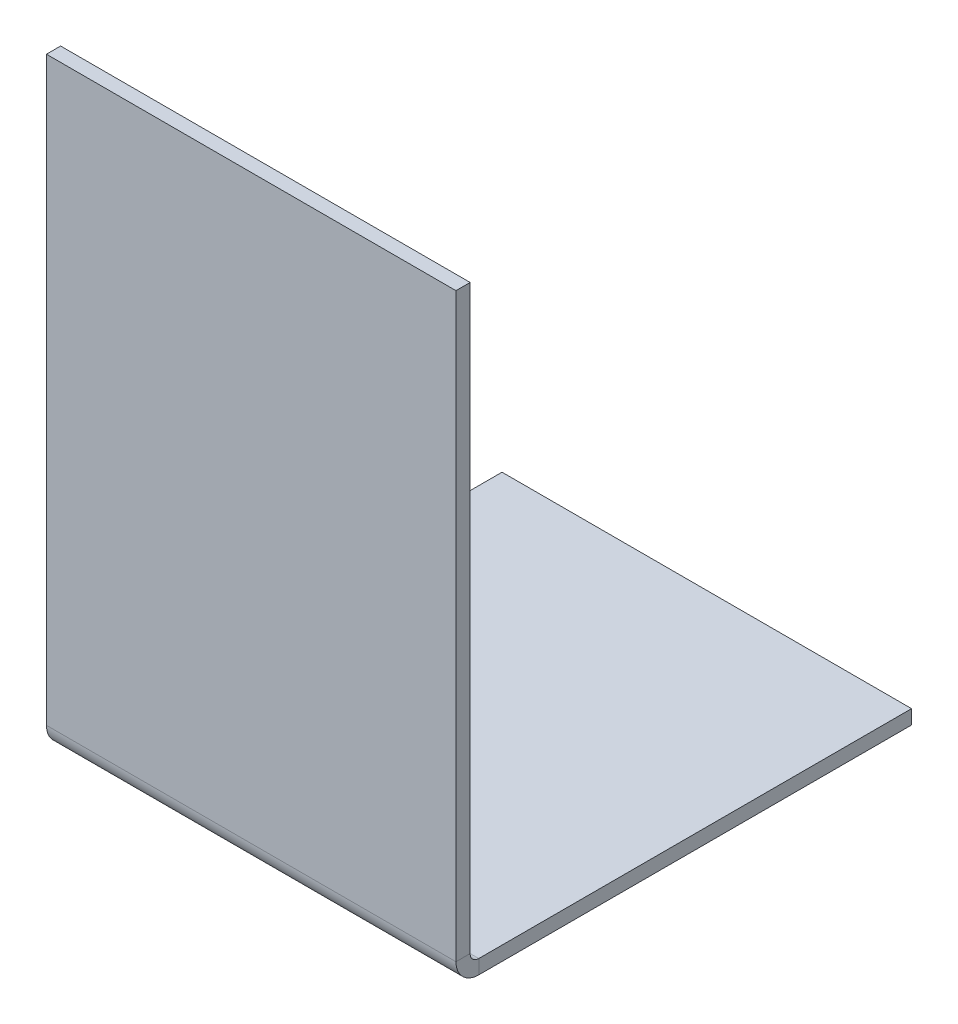
ISO-10303-21;
HEADER;
FILE_DESCRIPTION(('STEP AP214'),'2;1');
FILE_NAME('part.step','',(''),(''),'','','');
FILE_SCHEMA(('AUTOMOTIVE_DESIGN { 1 0 10303 214 1 1 1 1 }'));
ENDSEC;
DATA;
#1=APPLICATION_CONTEXT('core data for automotive mechanical design processes');
#2=APPLICATION_PROTOCOL_DEFINITION('international standard','automotive_design',2000,#1);
#3=PRODUCT_CONTEXT('',#1,'mechanical');
#4=PRODUCT('Part','Part','',(#3));
#5=PRODUCT_RELATED_PRODUCT_CATEGORY('part','',(#4));
#6=PRODUCT_DEFINITION_FORMATION('','',#4);
#7=PRODUCT_DEFINITION_CONTEXT('part definition',#1,'design');
#8=PRODUCT_DEFINITION('design','',#6,#7);
#9=PRODUCT_DEFINITION_SHAPE('','',#8);
#10=(LENGTH_UNIT() NAMED_UNIT(*) SI_UNIT(.MILLI.,.METRE.));
#11=(NAMED_UNIT(*) PLANE_ANGLE_UNIT() SI_UNIT($,.RADIAN.));
#12=(NAMED_UNIT(*) SI_UNIT($,.STERADIAN.) SOLID_ANGLE_UNIT());
#13=UNCERTAINTY_MEASURE_WITH_UNIT(LENGTH_MEASURE(1.E-05),#10,'distance_accuracy_value','');
#14=(GEOMETRIC_REPRESENTATION_CONTEXT(3) GLOBAL_UNCERTAINTY_ASSIGNED_CONTEXT((#13)) GLOBAL_UNIT_ASSIGNED_CONTEXT((#10,
#11,#12)) REPRESENTATION_CONTEXT('',''));
#15=CARTESIAN_POINT('',(0.,0.,0.));
#16=DIRECTION('',(0.,0.,1.));
#17=DIRECTION('',(1.,0.,0.));
#18=AXIS2_PLACEMENT_3D('',#15,#16,#17);
#19=CARTESIAN_POINT('',(17.526,50.4812919037694,-5.45458809623079));
#20=DIRECTION('',(1.,0.,0.));
#21=DIRECTION('',(0.,-1.,0.));
#22=AXIS2_PLACEMENT_3D('',#19,#20,#21);
#23=PLANE('',#22);
#24=DIRECTION('',(0.,-1.,0.));
#25=VECTOR('',#24,1.);
#26=CARTESIAN_POINT('',(17.526,50.4812919037694,-5.45458809623079));
#27=LINE('',#26,#25);
#28=CARTESIAN_POINT('',(17.526,50.4812919037694,-5.45458809623079));
#29=VERTEX_POINT('',#28);
#30=CARTESIAN_POINT('',(17.526,0.736600000000006,-5.45458809623062));
#31=VERTEX_POINT('',#30);
#32=EDGE_CURVE('E105',#29,#31,#27,.T.);
#33=ORIENTED_EDGE('',*,*,#32,.T.);
#34=DIRECTION('',(0.,0.,-1.));
#35=VECTOR('',#34,1.);
#36=CARTESIAN_POINT('',(17.526,0.736600000000006,-5.45458809623062));
#37=LINE('',#36,#35);
#38=CARTESIAN_POINT('',(17.526,0.736600000000004,-6.66870809623062));
#39=VERTEX_POINT('',#38);
#40=EDGE_CURVE('E12',#31,#39,#37,.T.);
#41=ORIENTED_EDGE('',*,*,#40,.T.);
#42=DIRECTION('',(0.,-1.,0.));
#43=VECTOR('',#42,1.);
#44=CARTESIAN_POINT('',(17.526,50.4812919037694,-6.66870809623079));
#45=LINE('',#44,#43);
#46=CARTESIAN_POINT('',(17.526,50.4812919037694,-6.66870809623079));
#47=VERTEX_POINT('',#46);
#48=EDGE_CURVE('E95',#47,#39,#45,.T.);
#49=ORIENTED_EDGE('',*,*,#48,.F.);
#50=DIRECTION('',(0.,0.,-1.));
#51=VECTOR('',#50,1.);
#52=CARTESIAN_POINT('',(17.526,50.4812919037694,-5.45458809623079));
#53=LINE('',#52,#51);
#54=EDGE_CURVE('E72',#29,#47,#53,.T.);
#55=ORIENTED_EDGE('',*,*,#54,.F.);
#56=EDGE_LOOP('',(#33,#41,#49,#55));
#57=FACE_BOUND('',#56,.T.);
#58=ADVANCED_FACE('F47',(#57),#23,.T.);
#59=CARTESIAN_POINT('',(-17.526,50.4812919037694,-5.45458809623079));
#60=DIRECTION('',(-1.,0.,0.));
#61=DIRECTION('',(0.,1.,0.));
#62=AXIS2_PLACEMENT_3D('',#59,#60,#61);
#63=PLANE('',#62);
#64=DIRECTION('',(0.,1.,0.));
#65=VECTOR('',#64,1.);
#66=CARTESIAN_POINT('',(-17.526,50.4812919037694,-6.66870809623079));
#67=LINE('',#66,#65);
#68=CARTESIAN_POINT('',(-17.526,0.736600000000004,-6.66870809623062));
#69=VERTEX_POINT('',#68);
#70=CARTESIAN_POINT('',(-17.526,50.4812919037694,-6.66870809623079));
#71=VERTEX_POINT('',#70);
#72=EDGE_CURVE('E99',#69,#71,#67,.T.);
#73=ORIENTED_EDGE('',*,*,#72,.F.);
#74=DIRECTION('',(0.,0.,1.));
#75=VECTOR('',#74,1.);
#76=CARTESIAN_POINT('',(-17.526,0.736600000000006,-5.45458809623062));
#77=LINE('',#76,#75);
#78=CARTESIAN_POINT('',(-17.526,0.73660000000001,-5.45458809623062));
#79=VERTEX_POINT('',#78);
#80=EDGE_CURVE('E114',#69,#79,#77,.T.);
#81=ORIENTED_EDGE('',*,*,#80,.T.);
#82=DIRECTION('',(0.,1.,0.));
#83=VECTOR('',#82,1.);
#84=CARTESIAN_POINT('',(-17.526,50.4812919037694,-5.45458809623079));
#85=LINE('',#84,#83);
#86=CARTESIAN_POINT('',(-17.526,50.4812919037694,-5.45458809623079));
#87=VERTEX_POINT('',#86);
#88=EDGE_CURVE('E50',#79,#87,#85,.T.);
#89=ORIENTED_EDGE('',*,*,#88,.T.);
#90=DIRECTION('',(0.,0.,-1.));
#91=VECTOR('',#90,1.);
#92=CARTESIAN_POINT('',(-17.526,50.4812919037694,-5.45458809623079));
#93=LINE('',#92,#91);
#94=EDGE_CURVE('E92',#87,#71,#93,.T.);
#95=ORIENTED_EDGE('',*,*,#94,.T.);
#96=EDGE_LOOP('',(#73,#81,#89,#95));
#97=FACE_BOUND('',#96,.T.);
#98=ADVANCED_FACE('F212',(#97),#63,.T.);
#99=CARTESIAN_POINT('',(0.,6.03129190376939,-5.45458809623064));
#100=DIRECTION('',(0.,0.,1.));
#101=DIRECTION('',(0.,-1.,0.));
#102=AXIS2_PLACEMENT_3D('',#99,#100,#101);
#103=PLANE('',#102);
#104=ORIENTED_EDGE('',*,*,#88,.F.);
#105=DIRECTION('',(1.,0.,0.));
#106=VECTOR('',#105,1.);
#107=CARTESIAN_POINT('',(0.,0.736600000000006,-5.45458809623062));
#108=LINE('',#107,#106);
#109=EDGE_CURVE('E91',#79,#31,#108,.T.);
#110=ORIENTED_EDGE('',*,*,#109,.T.);
#111=ORIENTED_EDGE('',*,*,#32,.F.);
#112=DIRECTION('',(1.,0.,0.));
#113=VECTOR('',#112,1.);
#114=CARTESIAN_POINT('',(-17.526,50.4812919037694,-5.45458809623079));
#115=LINE('',#114,#113);
#116=EDGE_CURVE('E90',#87,#29,#115,.T.);
#117=ORIENTED_EDGE('',*,*,#116,.F.);
#118=EDGE_LOOP('',(#104,#110,#111,#117));
#119=FACE_BOUND('',#118,.T.);
#120=ADVANCED_FACE('F210',(#119),#103,.T.);
#121=CARTESIAN_POINT('',(-17.526,50.4812919037694,-5.45458809623079));
#122=DIRECTION('',(0.,1.,0.));
#123=DIRECTION('',(1.,0.,0.));
#124=AXIS2_PLACEMENT_3D('',#121,#122,#123);
#125=PLANE('',#124);
#126=DIRECTION('',(1.,0.,0.));
#127=VECTOR('',#126,1.);
#128=CARTESIAN_POINT('',(-17.526,50.4812919037694,-6.66870809623079));
#129=LINE('',#128,#127);
#130=EDGE_CURVE('E88',#71,#47,#129,.T.);
#131=ORIENTED_EDGE('',*,*,#130,.F.);
#132=ORIENTED_EDGE('',*,*,#94,.F.);
#133=ORIENTED_EDGE('',*,*,#116,.T.);
#134=ORIENTED_EDGE('',*,*,#54,.T.);
#135=EDGE_LOOP('',(#131,#132,#133,#134));
#136=FACE_BOUND('',#135,.T.);
#137=ADVANCED_FACE('F85',(#136),#125,.T.);
#138=CARTESIAN_POINT('',(0.,6.03129190376939,-6.66870809623064));
#139=DIRECTION('',(0.,0.,1.));
#140=DIRECTION('',(0.,-1.,0.));
#141=AXIS2_PLACEMENT_3D('',#138,#139,#140);
#142=PLANE('',#141);
#143=DIRECTION('',(1.,0.,0.));
#144=VECTOR('',#143,1.);
#145=CARTESIAN_POINT('',(0.,0.736600000000001,-6.66870809623062));
#146=LINE('',#145,#144);
#147=EDGE_CURVE('E55',#69,#39,#146,.T.);
#148=ORIENTED_EDGE('',*,*,#147,.F.);
#149=ORIENTED_EDGE('',*,*,#72,.T.);
#150=ORIENTED_EDGE('',*,*,#130,.T.);
#151=ORIENTED_EDGE('',*,*,#48,.T.);
#152=EDGE_LOOP('',(#148,#149,#150,#151));
#153=FACE_BOUND('',#152,.T.);
#154=ADVANCED_FACE('F102',(#153),#142,.F.);
#155=CARTESIAN_POINT('',(-17.526,-1.21412,-44.45));
#156=DIRECTION('',(0.,0.,-1.));
#157=DIRECTION('',(-1.,0.,0.));
#158=AXIS2_PLACEMENT_3D('',#155,#156,#157);
#159=PLANE('',#158);
#160=DIRECTION('',(-1.,0.,0.));
#161=VECTOR('',#160,1.);
#162=CARTESIAN_POINT('',(-17.526,0.,-44.45));
#163=LINE('',#162,#161);
#164=CARTESIAN_POINT('',(17.526,0.,-44.45));
#165=VERTEX_POINT('',#164);
#166=CARTESIAN_POINT('',(-17.526,0.,-44.45));
#167=VERTEX_POINT('',#166);
#168=EDGE_CURVE('E147',#165,#167,#163,.T.);
#169=ORIENTED_EDGE('',*,*,#168,.F.);
#170=DIRECTION('',(0.,1.,0.));
#171=VECTOR('',#170,1.);
#172=CARTESIAN_POINT('',(17.526,-1.21412,-44.45));
#173=LINE('',#172,#171);
#174=CARTESIAN_POINT('',(17.526,-1.21412,-44.45));
#175=VERTEX_POINT('',#174);
#176=EDGE_CURVE('E100',#175,#165,#173,.T.);
#177=ORIENTED_EDGE('',*,*,#176,.F.);
#178=DIRECTION('',(-1.,0.,0.));
#179=VECTOR('',#178,1.);
#180=CARTESIAN_POINT('',(-17.526,-1.21412,-44.45));
#181=LINE('',#180,#179);
#182=CARTESIAN_POINT('',(-17.526,-1.21412,-44.45));
#183=VERTEX_POINT('',#182);
#184=EDGE_CURVE('E165',#175,#183,#181,.T.);
#185=ORIENTED_EDGE('',*,*,#184,.T.);
#186=DIRECTION('',(0.,1.,0.));
#187=VECTOR('',#186,1.);
#188=CARTESIAN_POINT('',(-17.526,-1.21412,-44.45));
#189=LINE('',#188,#187);
#190=EDGE_CURVE('E162',#183,#167,#189,.T.);
#191=ORIENTED_EDGE('',*,*,#190,.T.);
#192=EDGE_LOOP('',(#169,#177,#185,#191));
#193=FACE_BOUND('',#192,.T.);
#194=ADVANCED_FACE('F222',(#193),#159,.T.);
#195=CARTESIAN_POINT('',(0.,-1.21412,0.));
#196=DIRECTION('',(0.,-1.,0.));
#197=DIRECTION('',(0.,0.,-1.));
#198=AXIS2_PLACEMENT_3D('',#195,#196,#197);
#199=PLANE('',#198);
#200=DIRECTION('',(1.,0.,0.));
#201=VECTOR('',#200,1.);
#202=CARTESIAN_POINT('',(0.,-1.21412,-7.40530809623062));
#203=LINE('',#202,#201);
#204=CARTESIAN_POINT('',(-17.526,-1.21412,-7.40530809623062));
#205=VERTEX_POINT('',#204);
#206=CARTESIAN_POINT('',(17.526,-1.21412,-7.40530809623062));
#207=VERTEX_POINT('',#206);
#208=EDGE_CURVE('E171',#205,#207,#203,.T.);
#209=ORIENTED_EDGE('',*,*,#208,.F.);
#210=DIRECTION('',(0.,0.,1.));
#211=VECTOR('',#210,1.);
#212=CARTESIAN_POINT('',(-17.526,-1.21412,44.45));
#213=LINE('',#212,#211);
#214=EDGE_CURVE('E159',#183,#205,#213,.T.);
#215=ORIENTED_EDGE('',*,*,#214,.F.);
#216=ORIENTED_EDGE('',*,*,#184,.F.);
#217=DIRECTION('',(0.,0.,-1.));
#218=VECTOR('',#217,1.);
#219=CARTESIAN_POINT('',(17.526,-1.21412,44.45));
#220=LINE('',#219,#218);
#221=EDGE_CURVE('E144',#207,#175,#220,.T.);
#222=ORIENTED_EDGE('',*,*,#221,.F.);
#223=EDGE_LOOP('',(#209,#215,#216,#222));
#224=FACE_BOUND('',#223,.T.);
#225=ADVANCED_FACE('F180',(#224),#199,.T.);
#226=CARTESIAN_POINT('',(-17.526,-1.21412,44.45));
#227=DIRECTION('',(-1.,0.,0.));
#228=DIRECTION('',(0.,0.,1.));
#229=AXIS2_PLACEMENT_3D('',#226,#227,#228);
#230=PLANE('',#229);
#231=DIRECTION('',(0.,-1.,0.));
#232=VECTOR('',#231,1.);
#233=CARTESIAN_POINT('',(-17.526,-1.21412,-7.40530809623062));
#234=LINE('',#233,#232);
#235=CARTESIAN_POINT('',(-17.526,0.,-7.40530809623062));
#236=VERTEX_POINT('',#235);
#237=EDGE_CURVE('E168',#236,#205,#234,.T.);
#238=ORIENTED_EDGE('',*,*,#237,.F.);
#239=DIRECTION('',(0.,0.,1.));
#240=VECTOR('',#239,1.);
#241=CARTESIAN_POINT('',(-17.526,0.,44.45));
#242=LINE('',#241,#240);
#243=EDGE_CURVE('E156',#167,#236,#242,.T.);
#244=ORIENTED_EDGE('',*,*,#243,.F.);
#245=ORIENTED_EDGE('',*,*,#190,.F.);
#246=ORIENTED_EDGE('',*,*,#214,.T.);
#247=EDGE_LOOP('',(#238,#244,#245,#246));
#248=FACE_BOUND('',#247,.T.);
#249=ADVANCED_FACE('F193',(#248),#230,.T.);
#250=CARTESIAN_POINT('',(0.,0.,0.));
#251=DIRECTION('',(0.,-1.,0.));
#252=DIRECTION('',(0.,0.,-1.));
#253=AXIS2_PLACEMENT_3D('',#250,#251,#252);
#254=PLANE('',#253);
#255=ORIENTED_EDGE('',*,*,#243,.T.);
#256=DIRECTION('',(1.,0.,0.));
#257=VECTOR('',#256,1.);
#258=CARTESIAN_POINT('',(0.,0.,-7.40530809623062));
#259=LINE('',#258,#257);
#260=CARTESIAN_POINT('',(17.526,0.,-7.40530809623062));
#261=VERTEX_POINT('',#260);
#262=EDGE_CURVE('E153',#236,#261,#259,.T.);
#263=ORIENTED_EDGE('',*,*,#262,.T.);
#264=DIRECTION('',(0.,0.,-1.));
#265=VECTOR('',#264,1.);
#266=CARTESIAN_POINT('',(17.526,0.,44.45));
#267=LINE('',#266,#265);
#268=EDGE_CURVE('E150',#261,#165,#267,.T.);
#269=ORIENTED_EDGE('',*,*,#268,.T.);
#270=ORIENTED_EDGE('',*,*,#168,.T.);
#271=EDGE_LOOP('',(#255,#263,#269,#270));
#272=FACE_BOUND('',#271,.T.);
#273=ADVANCED_FACE('F198',(#272),#254,.F.);
#274=CARTESIAN_POINT('',(17.526,-1.21412,44.45));
#275=DIRECTION('',(1.,0.,0.));
#276=DIRECTION('',(0.,0.,-1.));
#277=AXIS2_PLACEMENT_3D('',#274,#275,#276);
#278=PLANE('',#277);
#279=DIRECTION('',(0.,1.,0.));
#280=VECTOR('',#279,1.);
#281=CARTESIAN_POINT('',(17.526,-1.21412,-7.40530809623062));
#282=LINE('',#281,#280);
#283=EDGE_CURVE('E134',#207,#261,#282,.T.);
#284=ORIENTED_EDGE('',*,*,#283,.F.);
#285=ORIENTED_EDGE('',*,*,#221,.T.);
#286=ORIENTED_EDGE('',*,*,#176,.T.);
#287=ORIENTED_EDGE('',*,*,#268,.F.);
#288=EDGE_LOOP('',(#284,#285,#286,#287));
#289=FACE_BOUND('',#288,.T.);
#290=ADVANCED_FACE('F232',(#289),#278,.T.);
#291=CARTESIAN_POINT('',(-17.526,0.7366,-7.40530809623062));
#292=DIRECTION('',(-1.,0.,0.));
#293=DIRECTION('',(0.,0.,1.));
#294=AXIS2_PLACEMENT_3D('',#291,#292,#293);
#295=PLANE('',#294);
#296=ORIENTED_EDGE('',*,*,#80,.F.);
#297=CARTESIAN_POINT('',(-17.526,0.7366,-7.40530809623062));
#298=DIRECTION('',(-1.,0.,0.));
#299=DIRECTION('',(0.,0.,1.));
#300=AXIS2_PLACEMENT_3D('',#297,#298,#299);
#301=CIRCLE('',#300,0.7366);
#302=EDGE_CURVE('E128',#69,#236,#301,.F.);
#303=ORIENTED_EDGE('',*,*,#302,.T.);
#304=ORIENTED_EDGE('',*,*,#237,.T.);
#305=CARTESIAN_POINT('',(-17.526,0.7366,-7.40530809623062));
#306=DIRECTION('',(1.,0.,0.));
#307=DIRECTION('',(0.,0.,1.));
#308=AXIS2_PLACEMENT_3D('',#305,#306,#307);
#309=CIRCLE('',#308,1.95072);
#310=EDGE_CURVE('E135',#79,#205,#309,.T.);
#311=ORIENTED_EDGE('',*,*,#310,.F.);
#312=EDGE_LOOP('',(#296,#303,#304,#311));
#313=FACE_BOUND('',#312,.T.);
#314=ADVANCED_FACE('F188',(#313),#295,.T.);
#315=CARTESIAN_POINT('',(17.526,0.7366,-7.40530809623062));
#316=DIRECTION('',(1.,0.,0.));
#317=DIRECTION('',(0.,0.,-1.));
#318=AXIS2_PLACEMENT_3D('',#315,#316,#317);
#319=PLANE('',#318);
#320=CARTESIAN_POINT('',(17.526,0.7366,-7.40530809623062));
#321=DIRECTION('',(-1.,0.,0.));
#322=DIRECTION('',(0.,0.,1.));
#323=AXIS2_PLACEMENT_3D('',#320,#321,#322);
#324=CIRCLE('',#323,0.7366);
#325=EDGE_CURVE('E125',#261,#39,#324,.T.);
#326=ORIENTED_EDGE('',*,*,#325,.T.);
#327=ORIENTED_EDGE('',*,*,#40,.F.);
#328=CARTESIAN_POINT('',(17.526,0.7366,-7.40530809623062));
#329=DIRECTION('',(-1.,0.,0.));
#330=DIRECTION('',(0.,0.,-1.));
#331=AXIS2_PLACEMENT_3D('',#328,#329,#330);
#332=CIRCLE('',#331,1.95072);
#333=EDGE_CURVE('E63',#207,#31,#332,.T.);
#334=ORIENTED_EDGE('',*,*,#333,.F.);
#335=ORIENTED_EDGE('',*,*,#283,.T.);
#336=EDGE_LOOP('',(#326,#327,#334,#335));
#337=FACE_BOUND('',#336,.T.);
#338=ADVANCED_FACE('F132',(#337),#319,.T.);
#339=CARTESIAN_POINT('',(35.1364695449938,0.7366,-7.40530809623062));
#340=DIRECTION('',(-1.,0.,0.));
#341=DIRECTION('',(0.,0.,1.));
#342=AXIS2_PLACEMENT_3D('',#339,#340,#341);
#343=CYLINDRICAL_SURFACE('',#342,1.95072);
#344=ORIENTED_EDGE('',*,*,#208,.T.);
#345=ORIENTED_EDGE('',*,*,#333,.T.);
#346=ORIENTED_EDGE('',*,*,#109,.F.);
#347=ORIENTED_EDGE('',*,*,#310,.T.);
#348=EDGE_LOOP('',(#344,#345,#346,#347));
#349=FACE_BOUND('',#348,.T.);
#350=ADVANCED_FACE('F174',(#349),#343,.T.);
#351=CARTESIAN_POINT('',(35.1364695449938,0.7366,-7.40530809623062));
#352=DIRECTION('',(-1.,0.,0.));
#353=DIRECTION('',(0.,0.,1.));
#354=AXIS2_PLACEMENT_3D('',#351,#352,#353);
#355=CYLINDRICAL_SURFACE('',#354,0.7366);
#356=ORIENTED_EDGE('',*,*,#262,.F.);
#357=ORIENTED_EDGE('',*,*,#302,.F.);
#358=ORIENTED_EDGE('',*,*,#147,.T.);
#359=ORIENTED_EDGE('',*,*,#325,.F.);
#360=EDGE_LOOP('',(#356,#357,#358,#359));
#361=FACE_BOUND('',#360,.T.);
#362=ADVANCED_FACE('F123',(#361),#355,.F.);
#363=CLOSED_SHELL('',(#58,#98,#120,#137,#154,#194,#225,#249,#273,#290,#314,#338,#350,#362));
#364=MANIFOLD_SOLID_BREP('B2',#363);
#365=ADVANCED_BREP_SHAPE_REPRESENTATION('',(#18,#364),#14);
#366=SHAPE_DEFINITION_REPRESENTATION(#9,#365);
ENDSEC;
END-ISO-10303-21;
